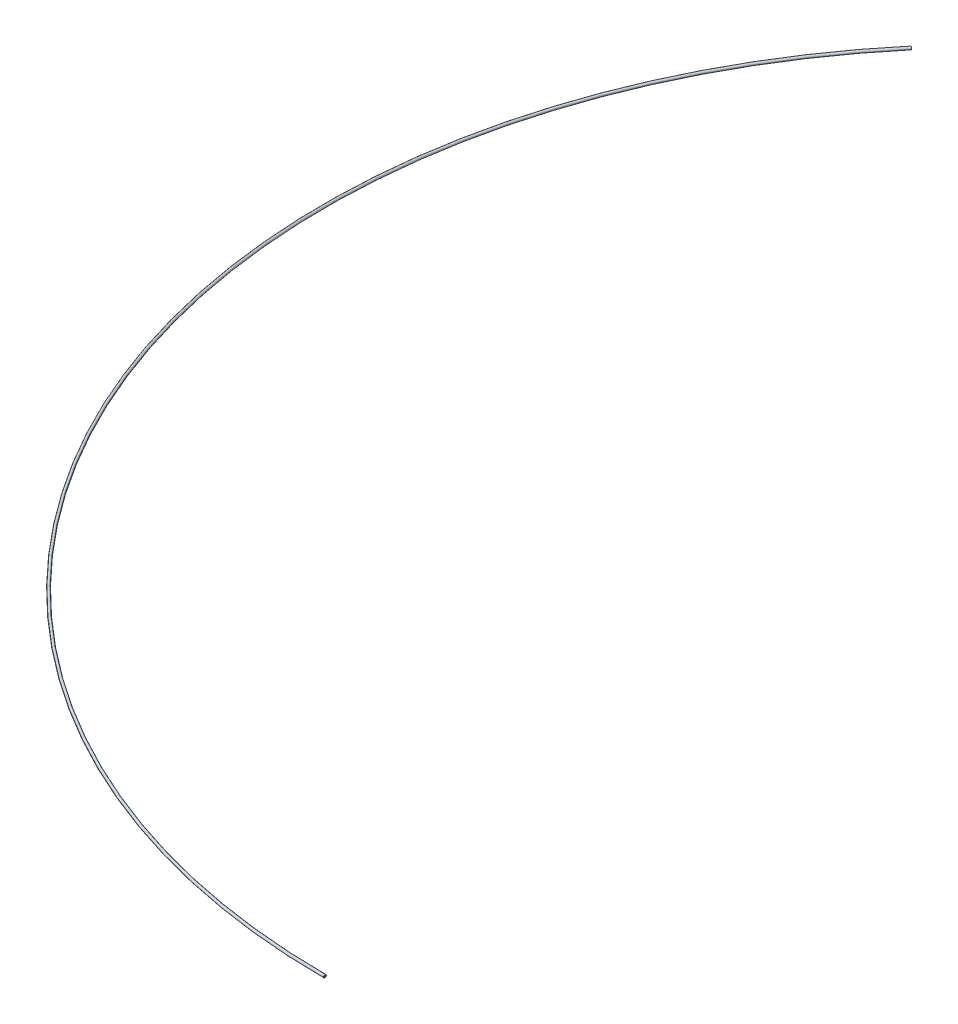
ISO-10303-21;
HEADER;
FILE_DESCRIPTION(('STEP AP214'),'2;1');
FILE_NAME('part.step','',(''),(''),'','','');
FILE_SCHEMA(('AUTOMOTIVE_DESIGN { 1 0 10303 214 1 1 1 1 }'));
ENDSEC;
DATA;
#1=APPLICATION_CONTEXT('core data for automotive mechanical design processes');
#2=APPLICATION_PROTOCOL_DEFINITION('international standard','automotive_design',2000,#1);
#3=PRODUCT_CONTEXT('',#1,'mechanical');
#4=PRODUCT('Part','Part','',(#3));
#5=PRODUCT_RELATED_PRODUCT_CATEGORY('part','',(#4));
#6=PRODUCT_DEFINITION_FORMATION('','',#4);
#7=PRODUCT_DEFINITION_CONTEXT('part definition',#1,'design');
#8=PRODUCT_DEFINITION('design','',#6,#7);
#9=PRODUCT_DEFINITION_SHAPE('','',#8);
#10=(LENGTH_UNIT() NAMED_UNIT(*) SI_UNIT(.MILLI.,.METRE.));
#11=(NAMED_UNIT(*) PLANE_ANGLE_UNIT() SI_UNIT($,.RADIAN.));
#12=(NAMED_UNIT(*) SI_UNIT($,.STERADIAN.) SOLID_ANGLE_UNIT());
#13=UNCERTAINTY_MEASURE_WITH_UNIT(LENGTH_MEASURE(1.E-05),#10,'distance_accuracy_value','');
#14=(GEOMETRIC_REPRESENTATION_CONTEXT(3) GLOBAL_UNCERTAINTY_ASSIGNED_CONTEXT((#13)) GLOBAL_UNIT_ASSIGNED_CONTEXT((#10,
#11,#12)) REPRESENTATION_CONTEXT('',''));
#15=CARTESIAN_POINT('',(0.,0.,0.));
#16=DIRECTION('',(0.,0.,1.));
#17=DIRECTION('',(1.,0.,0.));
#18=AXIS2_PLACEMENT_3D('',#15,#16,#17);
#19=CARTESIAN_POINT('',(0.,0.,283.856918182383));
#20=DIRECTION('',(0.,-1.,0.));
#21=DIRECTION('',(0.,0.,-1.));
#22=AXIS2_PLACEMENT_3D('',#19,#20,#21);
#23=TOROIDAL_SURFACE('',#22,440.143081817617,0.900000000000005);
#24=CARTESIAN_POINT('',(0.,0.,724.));
#25=DIRECTION('',(1.,0.,0.));
#26=DIRECTION('',(0.,0.,-1.));
#27=AXIS2_PLACEMENT_3D('',#24,#25,#26);
#28=CIRCLE('',#27,0.900000000000005);
#29=CARTESIAN_POINT('',(0.,0.,724.9));
#30=VERTEX_POINT('',#29);
#31=EDGE_CURVE('E38',#30,#30,#28,.T.);
#32=CARTESIAN_POINT('',(-336.844195268585,0.,0.551569511078709));
#33=DIRECTION('',(-0.64366648113919,0.,0.76530612244898));
#34=DIRECTION('',(0.76530612244898,0.,0.64366648113919));
#35=AXIS2_PLACEMENT_3D('',#32,#33,#34);
#36=CIRCLE('',#35,0.900000000000005);
#37=CARTESIAN_POINT('',(-337.532970778789,0.,-0.0277303219465841));
#38=VERTEX_POINT('',#37);
#39=EDGE_CURVE('E47',#38,#38,#36,.T.);
#40=CARTESIAN_POINT('',(0.,0.,283.856918182383));
#41=DIRECTION('',(0.,-1.,0.));
#42=DIRECTION('',(0.,0.,-1.));
#43=AXIS2_PLACEMENT_3D('',#40,#41,#42);
#44=CIRCLE('',#43,441.043081817617);
#45=EDGE_CURVE('',#30,#38,#44,.T.);
#46=ORIENTED_EDGE('',*,*,#31,.F.);
#47=ORIENTED_EDGE('',*,*,#39,.T.);
#48=ORIENTED_EDGE('',*,*,#45,.T.);
#49=ORIENTED_EDGE('',*,*,#45,.F.);
#50=EDGE_LOOP('',(#46,#48,#47,#49));
#51=FACE_BOUND('',#50,.T.);
#52=ADVANCED_FACE('F35',(#51),#23,.T.);
#53=CARTESIAN_POINT('',(0.,0.,724.));
#54=DIRECTION('',(1.,0.,0.));
#55=DIRECTION('',(0.,0.,-1.));
#56=AXIS2_PLACEMENT_3D('',#53,#54,#55);
#57=PLANE('',#56);
#58=CARTESIAN_POINT('',(0.,0.,724.));
#59=DIRECTION('',(1.,0.,0.));
#60=DIRECTION('',(0.,0.,-1.));
#61=AXIS2_PLACEMENT_3D('',#58,#59,#60);
#62=CIRCLE('',#61,0.50000000000003);
#63=CARTESIAN_POINT('',(0.,0.,724.5));
#64=VERTEX_POINT('',#63);
#65=EDGE_CURVE('E42',#64,#64,#62,.F.);
#66=ORIENTED_EDGE('',*,*,#65,.T.);
#67=EDGE_LOOP('',(#66));
#68=FACE_BOUND('',#67,.T.);
#69=ORIENTED_EDGE('',*,*,#31,.T.);
#70=EDGE_LOOP('',(#69));
#71=FACE_BOUND('',#70,.T.);
#72=ADVANCED_FACE('F55',(#68,#71),#57,.T.);
#73=CARTESIAN_POINT('',(-336.844195268585,0.,0.551569511078709));
#74=DIRECTION('',(-0.64366648113919,0.,0.76530612244898));
#75=DIRECTION('',(0.76530612244898,0.,0.64366648113919));
#76=AXIS2_PLACEMENT_3D('',#73,#74,#75);
#77=PLANE('',#76);
#78=CARTESIAN_POINT('',(-336.844195268585,0.,0.551569511078709));
#79=DIRECTION('',(-0.64366648113919,0.,0.76530612244898));
#80=DIRECTION('',(0.76530612244898,0.,0.64366648113919));
#81=AXIS2_PLACEMENT_3D('',#78,#79,#80);
#82=CIRCLE('',#81,0.50000000000003);
#83=CARTESIAN_POINT('',(-337.226848329809,0.,0.229736270509096));
#84=VERTEX_POINT('',#83);
#85=EDGE_CURVE('E10',#84,#84,#82,.F.);
#86=ORIENTED_EDGE('',*,*,#85,.F.);
#87=EDGE_LOOP('',(#86));
#88=FACE_BOUND('',#87,.T.);
#89=ORIENTED_EDGE('',*,*,#39,.F.);
#90=EDGE_LOOP('',(#89));
#91=FACE_BOUND('',#90,.T.);
#92=ADVANCED_FACE('F61',(#88,#91),#77,.F.);
#93=CARTESIAN_POINT('',(0.,0.,283.856918182383));
#94=DIRECTION('',(0.,-1.,0.));
#95=DIRECTION('',(0.,0.,-1.));
#96=AXIS2_PLACEMENT_3D('',#93,#94,#95);
#97=TOROIDAL_SURFACE('',#96,440.143081817617,0.50000000000003);
#98=CARTESIAN_POINT('',(0.,0.,283.856918182383));
#99=DIRECTION('',(0.,-1.,0.));
#100=DIRECTION('',(0.,0.,-1.));
#101=AXIS2_PLACEMENT_3D('',#98,#99,#100);
#102=CIRCLE('',#101,440.643081817617);
#103=EDGE_CURVE('',#64,#84,#102,.T.);
#104=ORIENTED_EDGE('',*,*,#65,.F.);
#105=ORIENTED_EDGE('',*,*,#85,.T.);
#106=ORIENTED_EDGE('',*,*,#103,.T.);
#107=ORIENTED_EDGE('',*,*,#103,.F.);
#108=EDGE_LOOP('',(#104,#106,#105,#107));
#109=FACE_BOUND('',#108,.T.);
#110=ADVANCED_FACE('F63',(#109),#97,.F.);
#111=CLOSED_SHELL('',(#52,#72,#92,#110));
#112=MANIFOLD_SOLID_BREP('B2',#111);
#113=ADVANCED_BREP_SHAPE_REPRESENTATION('',(#18,#112),#14);
#114=SHAPE_DEFINITION_REPRESENTATION(#9,#113);
ENDSEC;
END-ISO-10303-21;
